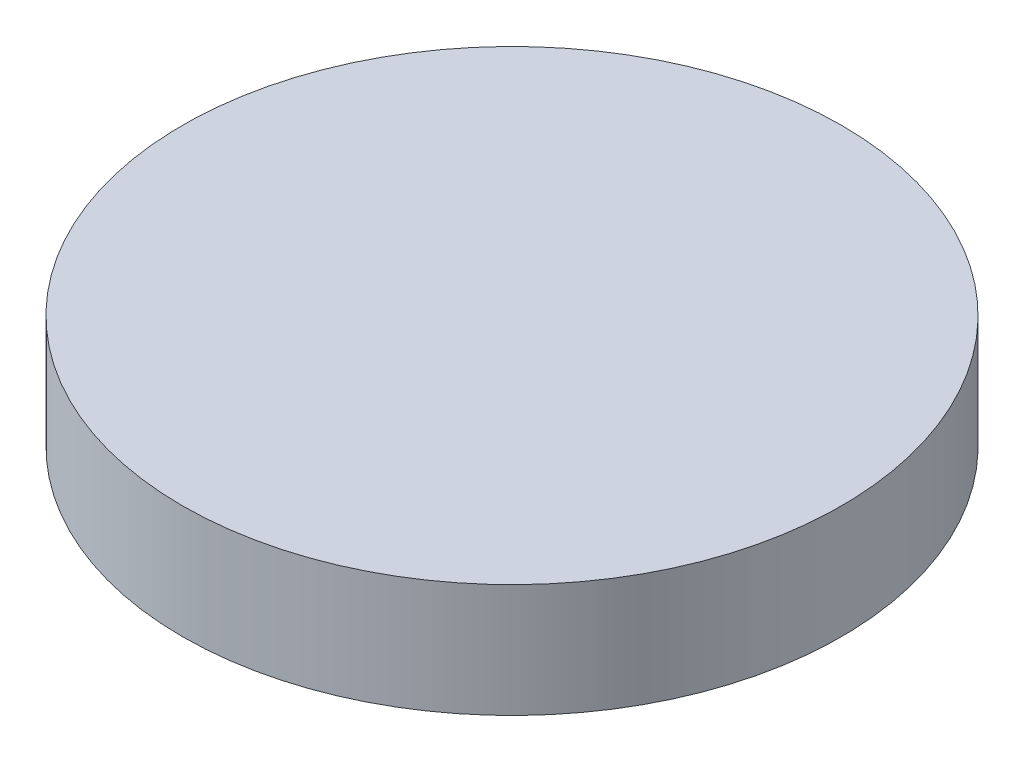
ISO-10303-21;
HEADER;
FILE_DESCRIPTION(('STEP AP214'),'2;1');
FILE_NAME('part.step','',(''),(''),'','','');
FILE_SCHEMA(('AUTOMOTIVE_DESIGN { 1 0 10303 214 1 1 1 1 }'));
ENDSEC;
DATA;
#1=APPLICATION_CONTEXT('core data for automotive mechanical design processes');
#2=APPLICATION_PROTOCOL_DEFINITION('international standard','automotive_design',2000,#1);
#3=PRODUCT_CONTEXT('',#1,'mechanical');
#4=PRODUCT('Part','Part','',(#3));
#5=PRODUCT_RELATED_PRODUCT_CATEGORY('part','',(#4));
#6=PRODUCT_DEFINITION_FORMATION('','',#4);
#7=PRODUCT_DEFINITION_CONTEXT('part definition',#1,'design');
#8=PRODUCT_DEFINITION('design','',#6,#7);
#9=PRODUCT_DEFINITION_SHAPE('','',#8);
#10=(LENGTH_UNIT() NAMED_UNIT(*) SI_UNIT(.MILLI.,.METRE.));
#11=(NAMED_UNIT(*) PLANE_ANGLE_UNIT() SI_UNIT($,.RADIAN.));
#12=(NAMED_UNIT(*) SI_UNIT($,.STERADIAN.) SOLID_ANGLE_UNIT());
#13=UNCERTAINTY_MEASURE_WITH_UNIT(LENGTH_MEASURE(1.E-05),#10,'distance_accuracy_value','');
#14=(GEOMETRIC_REPRESENTATION_CONTEXT(3) GLOBAL_UNCERTAINTY_ASSIGNED_CONTEXT((#13)) GLOBAL_UNIT_ASSIGNED_CONTEXT((#10,
#11,#12)) REPRESENTATION_CONTEXT('',''));
#15=CARTESIAN_POINT('',(0.,0.,0.));
#16=DIRECTION('',(0.,0.,1.));
#17=DIRECTION('',(1.,0.,0.));
#18=AXIS2_PLACEMENT_3D('',#15,#16,#17);
#19=CARTESIAN_POINT('',(0.,1.,0.));
#20=DIRECTION('',(0.,-1.,0.));
#21=DIRECTION('',(0.,0.,-1.));
#22=AXIS2_PLACEMENT_3D('',#19,#20,#21);
#23=CYLINDRICAL_SURFACE('',#22,2.9075);
#24=CARTESIAN_POINT('',(0.,1.,0.));
#25=DIRECTION('',(0.,1.,0.));
#26=DIRECTION('',(0.,0.,1.));
#27=AXIS2_PLACEMENT_3D('',#24,#25,#26);
#28=CIRCLE('',#27,2.9075);
#29=CARTESIAN_POINT('',(0.,1.,2.9075));
#30=VERTEX_POINT('',#29);
#31=EDGE_CURVE('E10',#30,#30,#28,.T.);
#32=ORIENTED_EDGE('',*,*,#31,.F.);
#33=EDGE_LOOP('',(#32));
#34=FACE_BOUND('',#33,.T.);
#35=CARTESIAN_POINT('',(0.,0.,0.));
#36=DIRECTION('',(0.,1.,0.));
#37=DIRECTION('',(0.,0.,1.));
#38=AXIS2_PLACEMENT_3D('',#35,#36,#37);
#39=CIRCLE('',#38,2.9075);
#40=CARTESIAN_POINT('',(0.,0.,2.9075));
#41=VERTEX_POINT('',#40);
#42=EDGE_CURVE('E38',#41,#41,#39,.T.);
#43=ORIENTED_EDGE('',*,*,#42,.T.);
#44=EDGE_LOOP('',(#43));
#45=FACE_BOUND('',#44,.T.);
#46=ADVANCED_FACE('F35',(#34,#45),#23,.T.);
#47=CARTESIAN_POINT('',(0.,1.,0.));
#48=DIRECTION('',(0.,1.,0.));
#49=DIRECTION('',(0.,0.,1.));
#50=AXIS2_PLACEMENT_3D('',#47,#48,#49);
#51=PLANE('',#50);
#52=ORIENTED_EDGE('',*,*,#31,.T.);
#53=EDGE_LOOP('',(#52));
#54=FACE_BOUND('',#53,.T.);
#55=ADVANCED_FACE('F50',(#54),#51,.T.);
#56=CARTESIAN_POINT('',(0.,0.,0.));
#57=DIRECTION('',(0.,1.,0.));
#58=DIRECTION('',(0.,0.,1.));
#59=AXIS2_PLACEMENT_3D('',#56,#57,#58);
#60=PLANE('',#59);
#61=ORIENTED_EDGE('',*,*,#42,.F.);
#62=EDGE_LOOP('',(#61));
#63=FACE_BOUND('',#62,.T.);
#64=ADVANCED_FACE('F48',(#63),#60,.F.);
#65=CLOSED_SHELL('',(#46,#55,#64));
#66=MANIFOLD_SOLID_BREP('B2',#65);
#67=ADVANCED_BREP_SHAPE_REPRESENTATION('',(#18,#66),#14);
#68=SHAPE_DEFINITION_REPRESENTATION(#9,#67);
ENDSEC;
END-ISO-10303-21;
